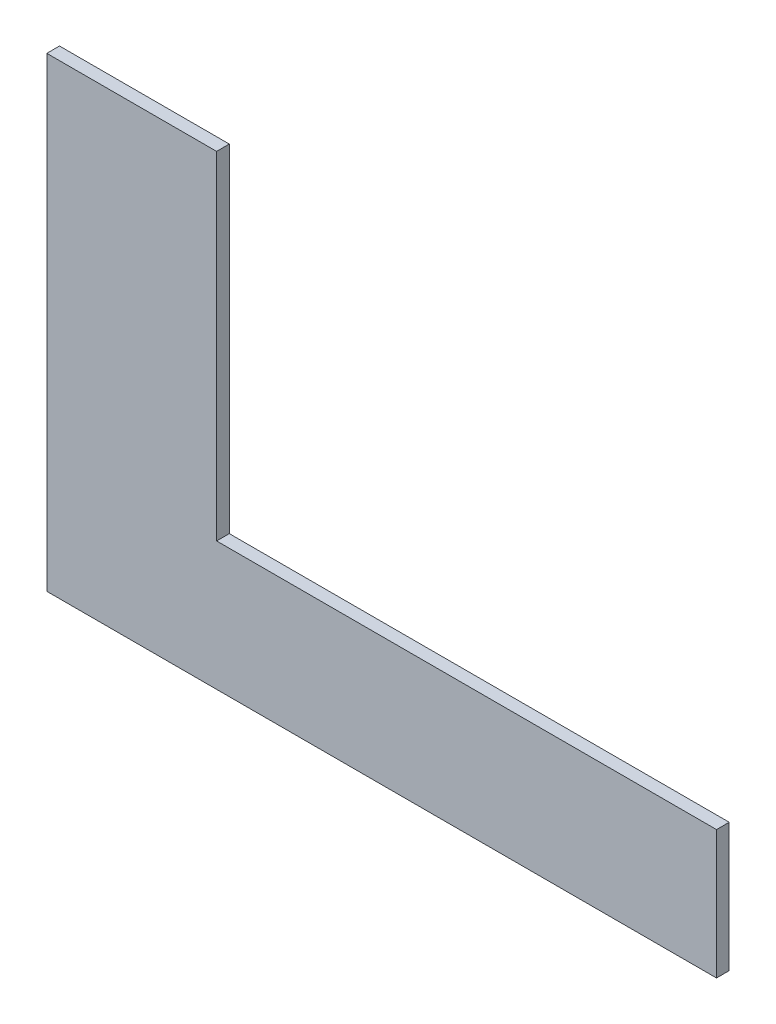
ISO-10303-21;
HEADER;
FILE_DESCRIPTION(('STEP AP214'),'2;1');
FILE_NAME('part.step','',(''),(''),'','','');
FILE_SCHEMA(('AUTOMOTIVE_DESIGN { 1 0 10303 214 1 1 1 1 }'));
ENDSEC;
DATA;
#1=APPLICATION_CONTEXT('core data for automotive mechanical design processes');
#2=APPLICATION_PROTOCOL_DEFINITION('international standard','automotive_design',2000,#1);
#3=PRODUCT_CONTEXT('',#1,'mechanical');
#4=PRODUCT('Part','Part','',(#3));
#5=PRODUCT_RELATED_PRODUCT_CATEGORY('part','',(#4));
#6=PRODUCT_DEFINITION_FORMATION('','',#4);
#7=PRODUCT_DEFINITION_CONTEXT('part definition',#1,'design');
#8=PRODUCT_DEFINITION('design','',#6,#7);
#9=PRODUCT_DEFINITION_SHAPE('','',#8);
#10=(LENGTH_UNIT() NAMED_UNIT(*) SI_UNIT(.MILLI.,.METRE.));
#11=(NAMED_UNIT(*) PLANE_ANGLE_UNIT() SI_UNIT($,.RADIAN.));
#12=(NAMED_UNIT(*) SI_UNIT($,.STERADIAN.) SOLID_ANGLE_UNIT());
#13=UNCERTAINTY_MEASURE_WITH_UNIT(LENGTH_MEASURE(1.E-05),#10,'distance_accuracy_value','');
#14=(GEOMETRIC_REPRESENTATION_CONTEXT(3) GLOBAL_UNCERTAINTY_ASSIGNED_CONTEXT((#13)) GLOBAL_UNIT_ASSIGNED_CONTEXT((#10,
#11,#12)) REPRESENTATION_CONTEXT('',''));
#15=CARTESIAN_POINT('',(0.,0.,0.));
#16=DIRECTION('',(0.,0.,1.));
#17=DIRECTION('',(1.,0.,0.));
#18=AXIS2_PLACEMENT_3D('',#15,#16,#17);
#19=CARTESIAN_POINT('',(-517.241071282177,843.539135514019,-40.));
#20=DIRECTION('',(1.,0.,0.));
#21=DIRECTION('',(0.,1.,0.));
#22=AXIS2_PLACEMENT_3D('',#19,#20,#21);
#23=PLANE('',#22);
#24=DIRECTION('',(0.,0.,1.));
#25=VECTOR('',#24,1.);
#26=CARTESIAN_POINT('',(-517.241071282177,576.539135514019,-40.));
#27=LINE('',#26,#25);
#28=CARTESIAN_POINT('',(-517.241071282177,576.539135514019,-40.));
#29=VERTEX_POINT('',#28);
#30=CARTESIAN_POINT('',(-517.241071282177,576.539135514019,0.));
#31=VERTEX_POINT('',#30);
#32=EDGE_CURVE('E92',#29,#31,#27,.T.);
#33=ORIENTED_EDGE('',*,*,#32,.T.);
#34=DIRECTION('',(0.,1.,0.));
#35=VECTOR('',#34,1.);
#36=CARTESIAN_POINT('',(-517.241071282177,843.539135514019,0.));
#37=LINE('',#36,#35);
#38=CARTESIAN_POINT('',(-517.241071282177,-486.460864485981,0.));
#39=VERTEX_POINT('',#38);
#40=EDGE_CURVE('E60',#39,#31,#37,.T.);
#41=ORIENTED_EDGE('',*,*,#40,.F.);
#42=DIRECTION('',(0.,0.,1.));
#43=VECTOR('',#42,1.);
#44=CARTESIAN_POINT('',(-517.241071282177,-486.460864485981,-40.));
#45=LINE('',#44,#43);
#46=CARTESIAN_POINT('',(-517.241071282177,-486.460864485981,-40.));
#47=VERTEX_POINT('',#46);
#48=EDGE_CURVE('E115',#47,#39,#45,.T.);
#49=ORIENTED_EDGE('',*,*,#48,.F.);
#50=DIRECTION('',(0.,1.,0.));
#51=VECTOR('',#50,1.);
#52=CARTESIAN_POINT('',(-517.241071282177,843.539135514019,-40.));
#53=LINE('',#52,#51);
#54=EDGE_CURVE('E120',#47,#29,#53,.T.);
#55=ORIENTED_EDGE('',*,*,#54,.T.);
#56=EDGE_LOOP('',(#33,#41,#49,#55));
#57=FACE_BOUND('',#56,.T.);
#58=ADVANCED_FACE('F38',(#57),#23,.T.);
#59=CARTESIAN_POINT('',(1057.75892871782,-126.460864485981,-40.));
#60=DIRECTION('',(1.,0.,0.));
#61=DIRECTION('',(0.,0.,-1.));
#62=AXIS2_PLACEMENT_3D('',#59,#60,#61);
#63=PLANE('',#62);
#64=DIRECTION('',(0.,0.,1.));
#65=VECTOR('',#64,1.);
#66=CARTESIAN_POINT('',(1057.75892871782,-486.460864485981,-40.));
#67=LINE('',#66,#65);
#68=CARTESIAN_POINT('',(1057.75892871782,-486.460864485981,-40.));
#69=VERTEX_POINT('',#68);
#70=CARTESIAN_POINT('',(1057.75892871782,-486.460864485981,0.));
#71=VERTEX_POINT('',#70);
#72=EDGE_CURVE('E125',#69,#71,#67,.T.);
#73=ORIENTED_EDGE('',*,*,#72,.T.);
#74=DIRECTION('',(0.,1.,0.));
#75=VECTOR('',#74,1.);
#76=CARTESIAN_POINT('',(1057.75892871782,-126.460864485981,0.));
#77=LINE('',#76,#75);
#78=CARTESIAN_POINT('',(1057.75892871782,-891.460864485981,0.));
#79=VERTEX_POINT('',#78);
#80=EDGE_CURVE('E112',#79,#71,#77,.T.);
#81=ORIENTED_EDGE('',*,*,#80,.F.);
#82=DIRECTION('',(0.,0.,1.));
#83=VECTOR('',#82,1.);
#84=CARTESIAN_POINT('',(1057.75892871782,-891.460864485981,-40.));
#85=LINE('',#84,#83);
#86=CARTESIAN_POINT('',(1057.75892871782,-891.460864485981,-40.));
#87=VERTEX_POINT('',#86);
#88=EDGE_CURVE('E130',#87,#79,#85,.T.);
#89=ORIENTED_EDGE('',*,*,#88,.F.);
#90=DIRECTION('',(0.,1.,0.));
#91=VECTOR('',#90,1.);
#92=CARTESIAN_POINT('',(1057.75892871782,-126.460864485981,-40.));
#93=LINE('',#92,#91);
#94=EDGE_CURVE('E110',#87,#69,#93,.T.);
#95=ORIENTED_EDGE('',*,*,#94,.T.);
#96=EDGE_LOOP('',(#73,#81,#89,#95));
#97=FACE_BOUND('',#96,.T.);
#98=ADVANCED_FACE('F142',(#97),#63,.T.);
#99=CARTESIAN_POINT('',(1057.75892871782,-891.460864485981,-40.));
#100=DIRECTION('',(0.,-1.,0.));
#101=DIRECTION('',(1.,0.,0.));
#102=AXIS2_PLACEMENT_3D('',#99,#100,#101);
#103=PLANE('',#102);
#104=DIRECTION('',(1.,0.,0.));
#105=VECTOR('',#104,1.);
#106=CARTESIAN_POINT('',(1057.75892871782,-891.460864485981,0.));
#107=LINE('',#106,#105);
#108=CARTESIAN_POINT('',(-1052.24107128218,-891.460864485981,0.));
#109=VERTEX_POINT('',#108);
#110=EDGE_CURVE('E124',#109,#79,#107,.T.);
#111=ORIENTED_EDGE('',*,*,#110,.F.);
#112=DIRECTION('',(0.,0.,1.));
#113=VECTOR('',#112,1.);
#114=CARTESIAN_POINT('',(-1052.24107128218,-891.460864485981,-40.));
#115=LINE('',#114,#113);
#116=CARTESIAN_POINT('',(-1052.24107128218,-891.460864485981,-40.));
#117=VERTEX_POINT('',#116);
#118=EDGE_CURVE('E122',#117,#109,#115,.T.);
#119=ORIENTED_EDGE('',*,*,#118,.F.);
#120=DIRECTION('',(1.,0.,0.));
#121=VECTOR('',#120,1.);
#122=CARTESIAN_POINT('',(1057.75892871782,-891.460864485981,-40.));
#123=LINE('',#122,#121);
#124=EDGE_CURVE('E108',#117,#87,#123,.T.);
#125=ORIENTED_EDGE('',*,*,#124,.T.);
#126=ORIENTED_EDGE('',*,*,#88,.T.);
#127=EDGE_LOOP('',(#111,#119,#125,#126));
#128=FACE_BOUND('',#127,.T.);
#129=ADVANCED_FACE('F148',(#128),#103,.T.);
#130=CARTESIAN_POINT('',(-1052.24107128218,-891.460864485981,-40.));
#131=DIRECTION('',(-1.,0.,0.));
#132=DIRECTION('',(0.,-1.,0.));
#133=AXIS2_PLACEMENT_3D('',#130,#131,#132);
#134=PLANE('',#133);
#135=DIRECTION('',(0.,0.,1.));
#136=VECTOR('',#135,1.);
#137=CARTESIAN_POINT('',(-1052.24107128218,576.539135514019,-40.));
#138=LINE('',#137,#136);
#139=CARTESIAN_POINT('',(-1052.24107128218,576.539135514019,-40.));
#140=VERTEX_POINT('',#139);
#141=CARTESIAN_POINT('',(-1052.24107128218,576.539135514019,0.));
#142=VERTEX_POINT('',#141);
#143=EDGE_CURVE('E53',#140,#142,#138,.T.);
#144=ORIENTED_EDGE('',*,*,#143,.F.);
#145=DIRECTION('',(0.,-1.,0.));
#146=VECTOR('',#145,1.);
#147=CARTESIAN_POINT('',(-1052.24107128218,-891.460864485981,-40.));
#148=LINE('',#147,#146);
#149=EDGE_CURVE('E100',#140,#117,#148,.T.);
#150=ORIENTED_EDGE('',*,*,#149,.T.);
#151=ORIENTED_EDGE('',*,*,#118,.T.);
#152=DIRECTION('',(0.,-1.,0.));
#153=VECTOR('',#152,1.);
#154=CARTESIAN_POINT('',(-1052.24107128218,-891.460864485981,0.));
#155=LINE('',#154,#153);
#156=EDGE_CURVE('E102',#142,#109,#155,.T.);
#157=ORIENTED_EDGE('',*,*,#156,.F.);
#158=EDGE_LOOP('',(#144,#150,#151,#157));
#159=FACE_BOUND('',#158,.T.);
#160=ADVANCED_FACE('F40',(#159),#134,.T.);
#161=CARTESIAN_POINT('',(0.,0.,-40.));
#162=DIRECTION('',(0.,0.,-1.));
#163=DIRECTION('',(-1.,0.,0.));
#164=AXIS2_PLACEMENT_3D('',#161,#162,#163);
#165=PLANE('',#164);
#166=DIRECTION('',(1.,0.,0.));
#167=VECTOR('',#166,1.);
#168=CARTESIAN_POINT('',(-1052.24107128218,576.539135514019,-40.));
#169=LINE('',#168,#167);
#170=EDGE_CURVE('E90',#140,#29,#169,.T.);
#171=ORIENTED_EDGE('',*,*,#170,.T.);
#172=ORIENTED_EDGE('',*,*,#54,.F.);
#173=DIRECTION('',(1.,0.,0.));
#174=VECTOR('',#173,1.);
#175=CARTESIAN_POINT('',(-517.241071282177,-486.460864485981,-40.));
#176=LINE('',#175,#174);
#177=EDGE_CURVE('E143',#47,#69,#176,.T.);
#178=ORIENTED_EDGE('',*,*,#177,.T.);
#179=ORIENTED_EDGE('',*,*,#94,.F.);
#180=ORIENTED_EDGE('',*,*,#124,.F.);
#181=ORIENTED_EDGE('',*,*,#149,.F.);
#182=EDGE_LOOP('',(#171,#172,#178,#179,#180,#181));
#183=FACE_BOUND('',#182,.T.);
#184=ADVANCED_FACE('F105',(#183),#165,.T.);
#185=CARTESIAN_POINT('',(0.,0.,0.));
#186=DIRECTION('',(0.,0.,-1.));
#187=DIRECTION('',(-1.,0.,0.));
#188=AXIS2_PLACEMENT_3D('',#185,#186,#187);
#189=PLANE('',#188);
#190=ORIENTED_EDGE('',*,*,#40,.T.);
#191=DIRECTION('',(-1.,0.,0.));
#192=VECTOR('',#191,1.);
#193=CARTESIAN_POINT('',(0.,576.539135514019,0.));
#194=LINE('',#193,#192);
#195=EDGE_CURVE('E11',#31,#142,#194,.T.);
#196=ORIENTED_EDGE('',*,*,#195,.T.);
#197=ORIENTED_EDGE('',*,*,#156,.T.);
#198=ORIENTED_EDGE('',*,*,#110,.T.);
#199=ORIENTED_EDGE('',*,*,#80,.T.);
#200=DIRECTION('',(-1.,0.,0.));
#201=VECTOR('',#200,1.);
#202=CARTESIAN_POINT('',(0.,-486.460864485981,0.));
#203=LINE('',#202,#201);
#204=EDGE_CURVE('E46',#71,#39,#203,.T.);
#205=ORIENTED_EDGE('',*,*,#204,.T.);
#206=EDGE_LOOP('',(#190,#196,#197,#198,#199,#205));
#207=FACE_BOUND('',#206,.T.);
#208=ADVANCED_FACE('F134',(#207),#189,.F.);
#209=CARTESIAN_POINT('',(-517.241071282177,-486.460864485981,-40.));
#210=DIRECTION('',(0.,-1.,0.));
#211=DIRECTION('',(0.,0.,-1.));
#212=AXIS2_PLACEMENT_3D('',#209,#210,#211);
#213=PLANE('',#212);
#214=ORIENTED_EDGE('',*,*,#72,.F.);
#215=ORIENTED_EDGE('',*,*,#177,.F.);
#216=ORIENTED_EDGE('',*,*,#48,.T.);
#217=ORIENTED_EDGE('',*,*,#204,.F.);
#218=EDGE_LOOP('',(#214,#215,#216,#217));
#219=FACE_BOUND('',#218,.T.);
#220=ADVANCED_FACE('F138',(#219),#213,.F.);
#221=CARTESIAN_POINT('',(-1052.24107128218,576.539135514019,-40.));
#222=DIRECTION('',(0.,-1.,0.));
#223=DIRECTION('',(0.,0.,-1.));
#224=AXIS2_PLACEMENT_3D('',#221,#222,#223);
#225=PLANE('',#224);
#226=ORIENTED_EDGE('',*,*,#32,.F.);
#227=ORIENTED_EDGE('',*,*,#170,.F.);
#228=ORIENTED_EDGE('',*,*,#143,.T.);
#229=ORIENTED_EDGE('',*,*,#195,.F.);
#230=EDGE_LOOP('',(#226,#227,#228,#229));
#231=FACE_BOUND('',#230,.T.);
#232=ADVANCED_FACE('F91',(#231),#225,.F.);
#233=CLOSED_SHELL('',(#58,#98,#129,#160,#184,#208,#220,#232));
#234=MANIFOLD_SOLID_BREP('B2',#233);
#235=ADVANCED_BREP_SHAPE_REPRESENTATION('',(#18,#234),#14);
#236=SHAPE_DEFINITION_REPRESENTATION(#9,#235);
ENDSEC;
END-ISO-10303-21;
